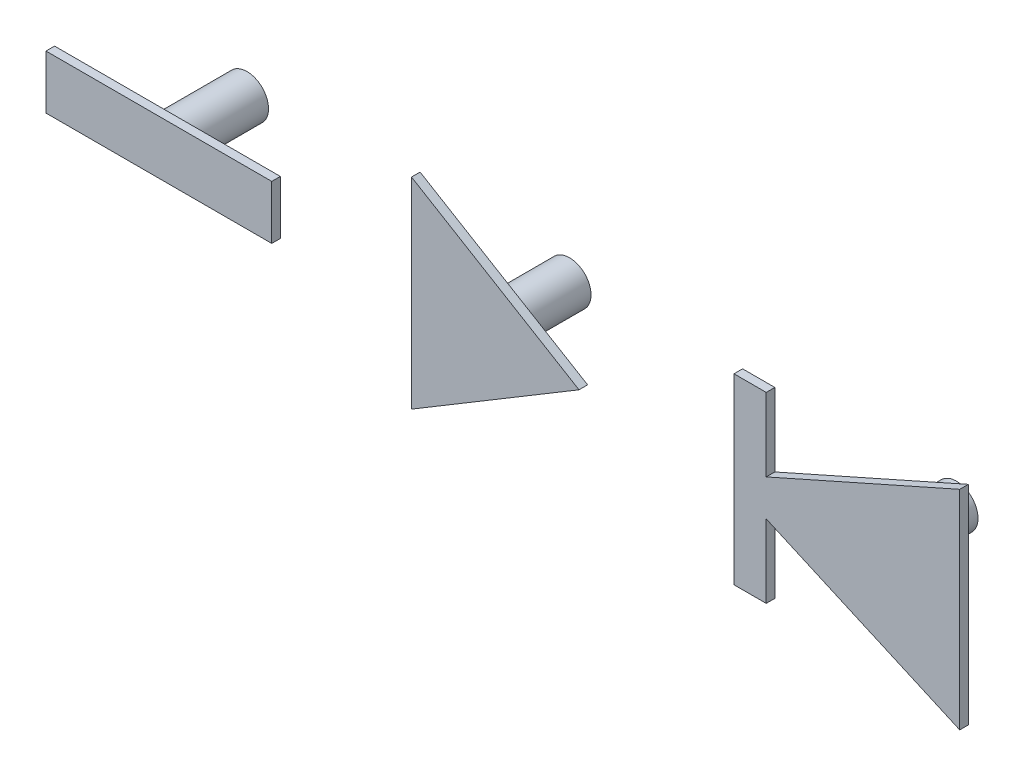
ISO-10303-21;
HEADER;
FILE_DESCRIPTION(('STEP AP214'),'2;1');
FILE_NAME('part.step','',(''),(''),'','','');
FILE_SCHEMA(('AUTOMOTIVE_DESIGN { 1 0 10303 214 1 1 1 1 }'));
ENDSEC;
DATA;
#1=APPLICATION_CONTEXT('core data for automotive mechanical design processes');
#2=APPLICATION_PROTOCOL_DEFINITION('international standard','automotive_design',2000,#1);
#3=PRODUCT_CONTEXT('',#1,'mechanical');
#4=PRODUCT('Part','Part','',(#3));
#5=PRODUCT_RELATED_PRODUCT_CATEGORY('part','',(#4));
#6=PRODUCT_DEFINITION_FORMATION('','',#4);
#7=PRODUCT_DEFINITION_CONTEXT('part definition',#1,'design');
#8=PRODUCT_DEFINITION('design','',#6,#7);
#9=PRODUCT_DEFINITION_SHAPE('','',#8);
#10=(LENGTH_UNIT() NAMED_UNIT(*) SI_UNIT(.MILLI.,.METRE.));
#11=(NAMED_UNIT(*) PLANE_ANGLE_UNIT() SI_UNIT($,.RADIAN.));
#12=(NAMED_UNIT(*) SI_UNIT($,.STERADIAN.) SOLID_ANGLE_UNIT());
#13=UNCERTAINTY_MEASURE_WITH_UNIT(LENGTH_MEASURE(1.E-05),#10,'distance_accuracy_value','');
#14=(GEOMETRIC_REPRESENTATION_CONTEXT(3) GLOBAL_UNCERTAINTY_ASSIGNED_CONTEXT((#13)) GLOBAL_UNIT_ASSIGNED_CONTEXT((#10,
#11,#12)) REPRESENTATION_CONTEXT('',''));
#15=CARTESIAN_POINT('',(0.,0.,0.));
#16=DIRECTION('',(0.,0.,1.));
#17=DIRECTION('',(1.,0.,0.));
#18=AXIS2_PLACEMENT_3D('',#15,#16,#17);
#19=CARTESIAN_POINT('',(-21.25,1.25,4.7));
#20=DIRECTION('',(-1.,0.,0.));
#21=DIRECTION('',(0.,0.,1.));
#22=AXIS2_PLACEMENT_3D('',#19,#20,#21);
#23=PLANE('',#22);
#24=DIRECTION('',(0.,0.,1.));
#25=VECTOR('',#24,1.);
#26=CARTESIAN_POINT('',(-21.25,-1.25,4.7));
#27=LINE('',#26,#25);
#28=CARTESIAN_POINT('',(-21.25,-1.25,4.7));
#29=VERTEX_POINT('',#28);
#30=CARTESIAN_POINT('',(-21.25,-1.25,5.1));
#31=VERTEX_POINT('',#30);
#32=EDGE_CURVE('E82',#29,#31,#27,.T.);
#33=ORIENTED_EDGE('',*,*,#32,.T.);
#34=DIRECTION('',(0.,-1.,0.));
#35=VECTOR('',#34,1.);
#36=CARTESIAN_POINT('',(-21.25,1.25,5.1));
#37=LINE('',#36,#35);
#38=CARTESIAN_POINT('',(-21.25,1.25,5.1));
#39=VERTEX_POINT('',#38);
#40=EDGE_CURVE('E85',#39,#31,#37,.T.);
#41=ORIENTED_EDGE('',*,*,#40,.F.);
#42=DIRECTION('',(0.,0.,1.));
#43=VECTOR('',#42,1.);
#44=CARTESIAN_POINT('',(-21.25,1.25,4.7));
#45=LINE('',#44,#43);
#46=CARTESIAN_POINT('',(-21.25,1.25,4.7));
#47=VERTEX_POINT('',#46);
#48=EDGE_CURVE('E12',#47,#39,#45,.T.);
#49=ORIENTED_EDGE('',*,*,#48,.F.);
#50=DIRECTION('',(0.,-1.,0.));
#51=VECTOR('',#50,1.);
#52=CARTESIAN_POINT('',(-21.25,1.25,4.7));
#53=LINE('',#52,#51);
#54=EDGE_CURVE('E86',#47,#29,#53,.T.);
#55=ORIENTED_EDGE('',*,*,#54,.T.);
#56=EDGE_LOOP('',(#33,#41,#49,#55));
#57=FACE_BOUND('',#56,.T.);
#58=ADVANCED_FACE('F44',(#57),#23,.T.);
#59=CARTESIAN_POINT('',(-21.25,1.25,4.7));
#60=DIRECTION('',(0.,1.,0.));
#61=DIRECTION('',(0.,0.,1.));
#62=AXIS2_PLACEMENT_3D('',#59,#60,#61);
#63=PLANE('',#62);
#64=ORIENTED_EDGE('',*,*,#48,.T.);
#65=DIRECTION('',(-1.,0.,0.));
#66=VECTOR('',#65,1.);
#67=CARTESIAN_POINT('',(-21.25,1.25,5.1));
#68=LINE('',#67,#66);
#69=CARTESIAN_POINT('',(-10.75,1.25,5.1));
#70=VERTEX_POINT('',#69);
#71=EDGE_CURVE('E102',#70,#39,#68,.T.);
#72=ORIENTED_EDGE('',*,*,#71,.F.);
#73=DIRECTION('',(0.,0.,1.));
#74=VECTOR('',#73,1.);
#75=CARTESIAN_POINT('',(-10.75,1.25,4.7));
#76=LINE('',#75,#74);
#77=CARTESIAN_POINT('',(-10.75,1.25,4.7));
#78=VERTEX_POINT('',#77);
#79=EDGE_CURVE('E52',#78,#70,#76,.T.);
#80=ORIENTED_EDGE('',*,*,#79,.F.);
#81=DIRECTION('',(-1.,0.,0.));
#82=VECTOR('',#81,1.);
#83=CARTESIAN_POINT('',(-21.25,1.25,4.7));
#84=LINE('',#83,#82);
#85=EDGE_CURVE('E91',#78,#47,#84,.T.);
#86=ORIENTED_EDGE('',*,*,#85,.T.);
#87=EDGE_LOOP('',(#64,#72,#80,#86));
#88=FACE_BOUND('',#87,.T.);
#89=ADVANCED_FACE('F121',(#88),#63,.T.);
#90=CARTESIAN_POINT('',(-10.75,1.25,4.7));
#91=DIRECTION('',(1.,0.,0.));
#92=DIRECTION('',(0.,0.,-1.));
#93=AXIS2_PLACEMENT_3D('',#90,#91,#92);
#94=PLANE('',#93);
#95=ORIENTED_EDGE('',*,*,#79,.T.);
#96=DIRECTION('',(0.,1.,0.));
#97=VECTOR('',#96,1.);
#98=CARTESIAN_POINT('',(-10.75,1.25,5.1));
#99=LINE('',#98,#97);
#100=CARTESIAN_POINT('',(-10.75,-1.25,5.1));
#101=VERTEX_POINT('',#100);
#102=EDGE_CURVE('E98',#101,#70,#99,.T.);
#103=ORIENTED_EDGE('',*,*,#102,.F.);
#104=DIRECTION('',(0.,0.,1.));
#105=VECTOR('',#104,1.);
#106=CARTESIAN_POINT('',(-10.75,-1.25,4.7));
#107=LINE('',#106,#105);
#108=CARTESIAN_POINT('',(-10.75,-1.25,4.7));
#109=VERTEX_POINT('',#108);
#110=EDGE_CURVE('E90',#109,#101,#107,.T.);
#111=ORIENTED_EDGE('',*,*,#110,.F.);
#112=DIRECTION('',(0.,1.,0.));
#113=VECTOR('',#112,1.);
#114=CARTESIAN_POINT('',(-10.75,1.25,4.7));
#115=LINE('',#114,#113);
#116=EDGE_CURVE('E113',#109,#78,#115,.T.);
#117=ORIENTED_EDGE('',*,*,#116,.T.);
#118=EDGE_LOOP('',(#95,#103,#111,#117));
#119=FACE_BOUND('',#118,.T.);
#120=ADVANCED_FACE('F118',(#119),#94,.T.);
#121=CARTESIAN_POINT('',(-21.25,-1.25,4.7));
#122=DIRECTION('',(0.,-1.,0.));
#123=DIRECTION('',(1.,0.,0.));
#124=AXIS2_PLACEMENT_3D('',#121,#122,#123);
#125=PLANE('',#124);
#126=ORIENTED_EDGE('',*,*,#110,.T.);
#127=DIRECTION('',(1.,0.,0.));
#128=VECTOR('',#127,1.);
#129=CARTESIAN_POINT('',(-21.25,-1.25,5.1));
#130=LINE('',#129,#128);
#131=EDGE_CURVE('E93',#31,#101,#130,.T.);
#132=ORIENTED_EDGE('',*,*,#131,.F.);
#133=ORIENTED_EDGE('',*,*,#32,.F.);
#134=DIRECTION('',(1.,0.,0.));
#135=VECTOR('',#134,1.);
#136=CARTESIAN_POINT('',(-21.25,-1.25,4.7));
#137=LINE('',#136,#135);
#138=EDGE_CURVE('E111',#29,#109,#137,.T.);
#139=ORIENTED_EDGE('',*,*,#138,.T.);
#140=EDGE_LOOP('',(#126,#132,#133,#139));
#141=FACE_BOUND('',#140,.T.);
#142=ADVANCED_FACE('F94',(#141),#125,.T.);
#143=CARTESIAN_POINT('',(0.,0.,4.7));
#144=DIRECTION('',(0.,0.,1.));
#145=DIRECTION('',(1.,0.,0.));
#146=AXIS2_PLACEMENT_3D('',#143,#144,#145);
#147=PLANE('',#146);
#148=CARTESIAN_POINT('',(-16.,0.,4.7));
#149=DIRECTION('',(0.,0.,1.));
#150=DIRECTION('',(1.,0.,0.));
#151=AXIS2_PLACEMENT_3D('',#148,#149,#150);
#152=CIRCLE('',#151,1.);
#153=CARTESIAN_POINT('',(-15.,0.,4.7));
#154=VERTEX_POINT('',#153);
#155=EDGE_CURVE('E47',#154,#154,#152,.T.);
#156=ORIENTED_EDGE('',*,*,#155,.T.);
#157=EDGE_LOOP('',(#156));
#158=FACE_BOUND('',#157,.T.);
#159=ORIENTED_EDGE('',*,*,#54,.F.);
#160=ORIENTED_EDGE('',*,*,#85,.F.);
#161=ORIENTED_EDGE('',*,*,#116,.F.);
#162=ORIENTED_EDGE('',*,*,#138,.F.);
#163=EDGE_LOOP('',(#159,#160,#161,#162));
#164=FACE_BOUND('',#163,.T.);
#165=ADVANCED_FACE('F123',(#158,#164),#147,.F.);
#166=CARTESIAN_POINT('',(0.,0.,5.1));
#167=DIRECTION('',(0.,0.,1.));
#168=DIRECTION('',(1.,0.,0.));
#169=AXIS2_PLACEMENT_3D('',#166,#167,#168);
#170=PLANE('',#169);
#171=ORIENTED_EDGE('',*,*,#40,.T.);
#172=ORIENTED_EDGE('',*,*,#131,.T.);
#173=ORIENTED_EDGE('',*,*,#102,.T.);
#174=ORIENTED_EDGE('',*,*,#71,.T.);
#175=EDGE_LOOP('',(#171,#172,#173,#174));
#176=FACE_BOUND('',#175,.T.);
#177=ADVANCED_FACE('F101',(#176),#170,.T.);
#178=CARTESIAN_POINT('',(-16.,0.,1.));
#179=DIRECTION('',(0.,0.,1.));
#180=DIRECTION('',(1.,0.,0.));
#181=AXIS2_PLACEMENT_3D('',#178,#179,#180);
#182=CYLINDRICAL_SURFACE('',#181,1.);
#183=CARTESIAN_POINT('',(-16.,0.,1.));
#184=DIRECTION('',(0.,0.,1.));
#185=DIRECTION('',(1.,0.,0.));
#186=AXIS2_PLACEMENT_3D('',#183,#184,#185);
#187=CIRCLE('',#186,1.);
#188=CARTESIAN_POINT('',(-15.,0.,1.));
#189=VERTEX_POINT('',#188);
#190=EDGE_CURVE('E105',#189,#189,#187,.T.);
#191=ORIENTED_EDGE('',*,*,#190,.T.);
#192=EDGE_LOOP('',(#191));
#193=FACE_BOUND('',#192,.T.);
#194=ORIENTED_EDGE('',*,*,#155,.F.);
#195=EDGE_LOOP('',(#194));
#196=FACE_BOUND('',#195,.T.);
#197=ADVANCED_FACE('F131',(#193,#196),#182,.T.);
#198=CARTESIAN_POINT('',(-16.,0.,1.));
#199=DIRECTION('',(0.,0.,1.));
#200=DIRECTION('',(1.,0.,0.));
#201=AXIS2_PLACEMENT_3D('',#198,#199,#200);
#202=PLANE('',#201);
#203=ORIENTED_EDGE('',*,*,#190,.F.);
#204=EDGE_LOOP('',(#203));
#205=FACE_BOUND('',#204,.T.);
#206=ADVANCED_FACE('F167',(#205),#202,.F.);
#207=CLOSED_SHELL('',(#58,#89,#120,#142,#165,#177,#197,#206));
#208=MANIFOLD_SOLID_BREP('B2',#207);
#209=CARTESIAN_POINT('',(12.25,4.25,4.7));
#210=DIRECTION('',(0.,1.,0.));
#211=DIRECTION('',(0.,0.,1.));
#212=AXIS2_PLACEMENT_3D('',#209,#210,#211);
#213=PLANE('',#212);
#214=DIRECTION('',(0.,0.,1.));
#215=VECTOR('',#214,1.);
#216=CARTESIAN_POINT('',(10.75,4.25,4.7));
#217=LINE('',#216,#215);
#218=CARTESIAN_POINT('',(10.75,4.25,4.7));
#219=VERTEX_POINT('',#218);
#220=CARTESIAN_POINT('',(10.75,4.25,5.1));
#221=VERTEX_POINT('',#220);
#222=EDGE_CURVE('E269',#219,#221,#217,.T.);
#223=ORIENTED_EDGE('',*,*,#222,.T.);
#224=DIRECTION('',(-1.,0.,0.));
#225=VECTOR('',#224,1.);
#226=CARTESIAN_POINT('',(12.25,4.25,5.1));
#227=LINE('',#226,#225);
#228=CARTESIAN_POINT('',(12.25,4.25,5.1));
#229=VERTEX_POINT('',#228);
#230=EDGE_CURVE('E272',#229,#221,#227,.T.);
#231=ORIENTED_EDGE('',*,*,#230,.F.);
#232=DIRECTION('',(0.,0.,1.));
#233=VECTOR('',#232,1.);
#234=CARTESIAN_POINT('',(12.25,4.25,4.7));
#235=LINE('',#234,#233);
#236=CARTESIAN_POINT('',(12.25,4.25,4.7));
#237=VERTEX_POINT('',#236);
#238=EDGE_CURVE('E42',#237,#229,#235,.T.);
#239=ORIENTED_EDGE('',*,*,#238,.F.);
#240=DIRECTION('',(-1.,0.,0.));
#241=VECTOR('',#240,1.);
#242=CARTESIAN_POINT('',(12.25,4.25,4.7));
#243=LINE('',#242,#241);
#244=EDGE_CURVE('E273',#237,#219,#243,.T.);
#245=ORIENTED_EDGE('',*,*,#244,.T.);
#246=EDGE_LOOP('',(#223,#231,#239,#245));
#247=FACE_BOUND('',#246,.T.);
#248=ADVANCED_FACE('F207',(#247),#213,.T.);
#249=CARTESIAN_POINT('',(12.25,0.845928516516991,4.7));
#250=DIRECTION('',(1.,0.,0.));
#251=DIRECTION('',(0.,0.,-1.));
#252=AXIS2_PLACEMENT_3D('',#249,#250,#251);
#253=PLANE('',#252);
#254=ORIENTED_EDGE('',*,*,#238,.T.);
#255=DIRECTION('',(0.,1.,0.));
#256=VECTOR('',#255,1.);
#257=CARTESIAN_POINT('',(12.25,0.845928516516991,5.1));
#258=LINE('',#257,#256);
#259=CARTESIAN_POINT('',(12.25,0.845928516516991,5.1));
#260=VERTEX_POINT('',#259);
#261=EDGE_CURVE('E290',#260,#229,#258,.T.);
#262=ORIENTED_EDGE('',*,*,#261,.F.);
#263=DIRECTION('',(0.,0.,1.));
#264=VECTOR('',#263,1.);
#265=CARTESIAN_POINT('',(12.25,0.845928516516991,4.7));
#266=LINE('',#265,#264);
#267=CARTESIAN_POINT('',(12.25,0.845928516516991,4.7));
#268=VERTEX_POINT('',#267);
#269=EDGE_CURVE('E215',#268,#260,#266,.T.);
#270=ORIENTED_EDGE('',*,*,#269,.F.);
#271=DIRECTION('',(0.,1.,0.));
#272=VECTOR('',#271,1.);
#273=CARTESIAN_POINT('',(12.25,0.845928516516991,4.7));
#274=LINE('',#273,#272);
#275=EDGE_CURVE('E278',#268,#237,#274,.T.);
#276=ORIENTED_EDGE('',*,*,#275,.T.);
#277=EDGE_LOOP('',(#254,#262,#270,#276));
#278=FACE_BOUND('',#277,.T.);
#279=ADVANCED_FACE('F358',(#278),#253,.T.);
#280=CARTESIAN_POINT('',(21.25,4.84592851651698,4.7));
#281=DIRECTION('',(-0.406138466053447,0.913811548620257,0.));
#282=DIRECTION('',(-0.913811548620257,-0.406138466053447,0.));
#283=AXIS2_PLACEMENT_3D('',#280,#281,#282);
#284=PLANE('',#283);
#285=ORIENTED_EDGE('',*,*,#269,.T.);
#286=DIRECTION('',(-0.913811548620257,-0.406138466053447,0.));
#287=VECTOR('',#286,1.);
#288=CARTESIAN_POINT('',(21.25,4.84592851651698,5.1));
#289=LINE('',#288,#287);
#290=CARTESIAN_POINT('',(21.25,4.84592851651698,5.1));
#291=VERTEX_POINT('',#290);
#292=EDGE_CURVE('E306',#291,#260,#289,.T.);
#293=ORIENTED_EDGE('',*,*,#292,.F.);
#294=DIRECTION('',(0.,0.,1.));
#295=VECTOR('',#294,1.);
#296=CARTESIAN_POINT('',(21.25,4.84592851651698,4.7));
#297=LINE('',#296,#295);
#298=CARTESIAN_POINT('',(21.25,4.84592851651698,4.7));
#299=VERTEX_POINT('',#298);
#300=EDGE_CURVE('E328',#299,#291,#297,.T.);
#301=ORIENTED_EDGE('',*,*,#300,.F.);
#302=DIRECTION('',(-0.913811548620257,-0.406138466053447,0.));
#303=VECTOR('',#302,1.);
#304=CARTESIAN_POINT('',(21.25,4.84592851651698,4.7));
#305=LINE('',#304,#303);
#306=EDGE_CURVE('E324',#299,#268,#305,.T.);
#307=ORIENTED_EDGE('',*,*,#306,.T.);
#308=EDGE_LOOP('',(#285,#293,#301,#307));
#309=FACE_BOUND('',#308,.T.);
#310=ADVANCED_FACE('F357',(#309),#284,.T.);
#311=CARTESIAN_POINT('',(21.25,-4.84592851651699,4.7));
#312=DIRECTION('',(1.,0.,0.));
#313=DIRECTION('',(0.,0.,-1.));
#314=AXIS2_PLACEMENT_3D('',#311,#312,#313);
#315=PLANE('',#314);
#316=ORIENTED_EDGE('',*,*,#300,.T.);
#317=DIRECTION('',(0.,1.,0.));
#318=VECTOR('',#317,1.);
#319=CARTESIAN_POINT('',(21.25,-4.84592851651699,5.1));
#320=LINE('',#319,#318);
#321=CARTESIAN_POINT('',(21.25,-4.84592851651699,5.1));
#322=VERTEX_POINT('',#321);
#323=EDGE_CURVE('E303',#322,#291,#320,.T.);
#324=ORIENTED_EDGE('',*,*,#323,.F.);
#325=DIRECTION('',(0.,0.,1.));
#326=VECTOR('',#325,1.);
#327=CARTESIAN_POINT('',(21.25,-4.84592851651699,4.7));
#328=LINE('',#327,#326);
#329=CARTESIAN_POINT('',(21.25,-4.84592851651699,4.7));
#330=VERTEX_POINT('',#329);
#331=EDGE_CURVE('E330',#330,#322,#328,.T.);
#332=ORIENTED_EDGE('',*,*,#331,.F.);
#333=DIRECTION('',(0.,1.,0.));
#334=VECTOR('',#333,1.);
#335=CARTESIAN_POINT('',(21.25,-4.84592851651699,4.7));
#336=LINE('',#335,#334);
#337=EDGE_CURVE('E321',#330,#299,#336,.T.);
#338=ORIENTED_EDGE('',*,*,#337,.T.);
#339=EDGE_LOOP('',(#316,#324,#332,#338));
#340=FACE_BOUND('',#339,.T.);
#341=ADVANCED_FACE('F353',(#340),#315,.T.);
#342=CARTESIAN_POINT('',(12.25,-0.845928516516989,4.7));
#343=DIRECTION('',(-0.406138466053448,-0.913811548620257,0.));
#344=DIRECTION('',(0.913811548620257,-0.406138466053448,0.));
#345=AXIS2_PLACEMENT_3D('',#342,#343,#344);
#346=PLANE('',#345);
#347=ORIENTED_EDGE('',*,*,#331,.T.);
#348=DIRECTION('',(0.913811548620257,-0.406138466053448,0.));
#349=VECTOR('',#348,1.);
#350=CARTESIAN_POINT('',(12.25,-0.845928516516989,5.1));
#351=LINE('',#350,#349);
#352=CARTESIAN_POINT('',(12.25,-0.845928516516989,5.1));
#353=VERTEX_POINT('',#352);
#354=EDGE_CURVE('E300',#353,#322,#351,.T.);
#355=ORIENTED_EDGE('',*,*,#354,.F.);
#356=DIRECTION('',(0.,0.,1.));
#357=VECTOR('',#356,1.);
#358=CARTESIAN_POINT('',(12.25,-0.845928516516989,4.7));
#359=LINE('',#358,#357);
#360=CARTESIAN_POINT('',(12.25,-0.845928516516989,4.7));
#361=VERTEX_POINT('',#360);
#362=EDGE_CURVE('E332',#361,#353,#359,.T.);
#363=ORIENTED_EDGE('',*,*,#362,.F.);
#364=DIRECTION('',(0.913811548620257,-0.406138466053448,0.));
#365=VECTOR('',#364,1.);
#366=CARTESIAN_POINT('',(12.25,-0.845928516516989,4.7));
#367=LINE('',#366,#365);
#368=EDGE_CURVE('E318',#361,#330,#367,.T.);
#369=ORIENTED_EDGE('',*,*,#368,.T.);
#370=EDGE_LOOP('',(#347,#355,#363,#369));
#371=FACE_BOUND('',#370,.T.);
#372=ADVANCED_FACE('F346',(#371),#346,.T.);
#373=CARTESIAN_POINT('',(12.25,-4.25,4.7));
#374=DIRECTION('',(1.,0.,0.));
#375=DIRECTION('',(0.,0.,-1.));
#376=AXIS2_PLACEMENT_3D('',#373,#374,#375);
#377=PLANE('',#376);
#378=ORIENTED_EDGE('',*,*,#362,.T.);
#379=DIRECTION('',(0.,1.,0.));
#380=VECTOR('',#379,1.);
#381=CARTESIAN_POINT('',(12.25,-4.25,5.1));
#382=LINE('',#381,#380);
#383=CARTESIAN_POINT('',(12.25,-4.25,5.1));
#384=VERTEX_POINT('',#383);
#385=EDGE_CURVE('E297',#384,#353,#382,.T.);
#386=ORIENTED_EDGE('',*,*,#385,.F.);
#387=DIRECTION('',(0.,0.,1.));
#388=VECTOR('',#387,1.);
#389=CARTESIAN_POINT('',(12.25,-4.25,4.7));
#390=LINE('',#389,#388);
#391=CARTESIAN_POINT('',(12.25,-4.25,4.7));
#392=VERTEX_POINT('',#391);
#393=EDGE_CURVE('E334',#392,#384,#390,.T.);
#394=ORIENTED_EDGE('',*,*,#393,.F.);
#395=DIRECTION('',(0.,1.,0.));
#396=VECTOR('',#395,1.);
#397=CARTESIAN_POINT('',(12.25,-4.25,4.7));
#398=LINE('',#397,#396);
#399=EDGE_CURVE('E315',#392,#361,#398,.T.);
#400=ORIENTED_EDGE('',*,*,#399,.T.);
#401=EDGE_LOOP('',(#378,#386,#394,#400));
#402=FACE_BOUND('',#401,.T.);
#403=ADVANCED_FACE('F343',(#402),#377,.T.);
#404=CARTESIAN_POINT('',(10.75,-4.25,4.7));
#405=DIRECTION('',(0.,-1.,0.));
#406=DIRECTION('',(0.,0.,-1.));
#407=AXIS2_PLACEMENT_3D('',#404,#405,#406);
#408=PLANE('',#407);
#409=ORIENTED_EDGE('',*,*,#393,.T.);
#410=DIRECTION('',(1.,0.,0.));
#411=VECTOR('',#410,1.);
#412=CARTESIAN_POINT('',(10.75,-4.25,5.1));
#413=LINE('',#412,#411);
#414=CARTESIAN_POINT('',(10.75,-4.25,5.1));
#415=VERTEX_POINT('',#414);
#416=EDGE_CURVE('E285',#415,#384,#413,.T.);
#417=ORIENTED_EDGE('',*,*,#416,.F.);
#418=DIRECTION('',(0.,0.,1.));
#419=VECTOR('',#418,1.);
#420=CARTESIAN_POINT('',(10.75,-4.25,4.7));
#421=LINE('',#420,#419);
#422=CARTESIAN_POINT('',(10.75,-4.25,4.7));
#423=VERTEX_POINT('',#422);
#424=EDGE_CURVE('E277',#423,#415,#421,.T.);
#425=ORIENTED_EDGE('',*,*,#424,.F.);
#426=DIRECTION('',(1.,0.,0.));
#427=VECTOR('',#426,1.);
#428=CARTESIAN_POINT('',(10.75,-4.25,4.7));
#429=LINE('',#428,#427);
#430=EDGE_CURVE('E312',#423,#392,#429,.T.);
#431=ORIENTED_EDGE('',*,*,#430,.T.);
#432=EDGE_LOOP('',(#409,#417,#425,#431));
#433=FACE_BOUND('',#432,.T.);
#434=ADVANCED_FACE('F337',(#433),#408,.T.);
#435=CARTESIAN_POINT('',(10.75,4.25,4.7));
#436=DIRECTION('',(-1.,0.,0.));
#437=DIRECTION('',(0.,0.,1.));
#438=AXIS2_PLACEMENT_3D('',#435,#436,#437);
#439=PLANE('',#438);
#440=ORIENTED_EDGE('',*,*,#424,.T.);
#441=DIRECTION('',(0.,-1.,0.));
#442=VECTOR('',#441,1.);
#443=CARTESIAN_POINT('',(10.75,4.25,5.1));
#444=LINE('',#443,#442);
#445=EDGE_CURVE('E280',#221,#415,#444,.T.);
#446=ORIENTED_EDGE('',*,*,#445,.F.);
#447=ORIENTED_EDGE('',*,*,#222,.F.);
#448=DIRECTION('',(0.,-1.,0.));
#449=VECTOR('',#448,1.);
#450=CARTESIAN_POINT('',(10.75,4.25,4.7));
#451=LINE('',#450,#449);
#452=EDGE_CURVE('E310',#219,#423,#451,.T.);
#453=ORIENTED_EDGE('',*,*,#452,.T.);
#454=EDGE_LOOP('',(#440,#446,#447,#453));
#455=FACE_BOUND('',#454,.T.);
#456=ADVANCED_FACE('F281',(#455),#439,.T.);
#457=CARTESIAN_POINT('',(0.,0.,4.7));
#458=DIRECTION('',(0.,0.,1.));
#459=DIRECTION('',(1.,0.,0.));
#460=AXIS2_PLACEMENT_3D('',#457,#458,#459);
#461=PLANE('',#460);
#462=CARTESIAN_POINT('',(17.,0.,4.7));
#463=DIRECTION('',(0.,0.,1.));
#464=DIRECTION('',(1.,0.,0.));
#465=AXIS2_PLACEMENT_3D('',#462,#463,#464);
#466=CIRCLE('',#465,1.);
#467=CARTESIAN_POINT('',(18.,0.,4.7));
#468=VERTEX_POINT('',#467);
#469=EDGE_CURVE('E210',#468,#468,#466,.T.);
#470=ORIENTED_EDGE('',*,*,#469,.T.);
#471=EDGE_LOOP('',(#470));
#472=FACE_BOUND('',#471,.T.);
#473=ORIENTED_EDGE('',*,*,#244,.F.);
#474=ORIENTED_EDGE('',*,*,#275,.F.);
#475=ORIENTED_EDGE('',*,*,#306,.F.);
#476=ORIENTED_EDGE('',*,*,#337,.F.);
#477=ORIENTED_EDGE('',*,*,#368,.F.);
#478=ORIENTED_EDGE('',*,*,#399,.F.);
#479=ORIENTED_EDGE('',*,*,#430,.F.);
#480=ORIENTED_EDGE('',*,*,#452,.F.);
#481=EDGE_LOOP('',(#473,#474,#475,#476,#477,#478,#479,#480));
#482=FACE_BOUND('',#481,.T.);
#483=ADVANCED_FACE('F349',(#472,#482),#461,.F.);
#484=CARTESIAN_POINT('',(0.,0.,5.1));
#485=DIRECTION('',(0.,0.,1.));
#486=DIRECTION('',(1.,0.,0.));
#487=AXIS2_PLACEMENT_3D('',#484,#485,#486);
#488=PLANE('',#487);
#489=ORIENTED_EDGE('',*,*,#230,.T.);
#490=ORIENTED_EDGE('',*,*,#445,.T.);
#491=ORIENTED_EDGE('',*,*,#416,.T.);
#492=ORIENTED_EDGE('',*,*,#385,.T.);
#493=ORIENTED_EDGE('',*,*,#354,.T.);
#494=ORIENTED_EDGE('',*,*,#323,.T.);
#495=ORIENTED_EDGE('',*,*,#292,.T.);
#496=ORIENTED_EDGE('',*,*,#261,.T.);
#497=EDGE_LOOP('',(#489,#490,#491,#492,#493,#494,#495,#496));
#498=FACE_BOUND('',#497,.T.);
#499=ADVANCED_FACE('F288',(#498),#488,.T.);
#500=CARTESIAN_POINT('',(17.,0.,1.));
#501=DIRECTION('',(0.,0.,1.));
#502=DIRECTION('',(1.,0.,0.));
#503=AXIS2_PLACEMENT_3D('',#500,#501,#502);
#504=CYLINDRICAL_SURFACE('',#503,1.);
#505=CARTESIAN_POINT('',(17.,0.,1.));
#506=DIRECTION('',(0.,0.,1.));
#507=DIRECTION('',(1.,0.,0.));
#508=AXIS2_PLACEMENT_3D('',#505,#506,#507);
#509=CIRCLE('',#508,1.);
#510=CARTESIAN_POINT('',(18.,0.,1.));
#511=VERTEX_POINT('',#510);
#512=EDGE_CURVE('E293',#511,#511,#509,.T.);
#513=ORIENTED_EDGE('',*,*,#512,.T.);
#514=EDGE_LOOP('',(#513));
#515=FACE_BOUND('',#514,.T.);
#516=ORIENTED_EDGE('',*,*,#469,.F.);
#517=EDGE_LOOP('',(#516));
#518=FACE_BOUND('',#517,.T.);
#519=ADVANCED_FACE('F384',(#515,#518),#504,.T.);
#520=CARTESIAN_POINT('',(17.,0.,1.));
#521=DIRECTION('',(0.,0.,1.));
#522=DIRECTION('',(1.,0.,0.));
#523=AXIS2_PLACEMENT_3D('',#520,#521,#522);
#524=PLANE('',#523);
#525=ORIENTED_EDGE('',*,*,#512,.F.);
#526=EDGE_LOOP('',(#525));
#527=FACE_BOUND('',#526,.T.);
#528=ADVANCED_FACE('F388',(#527),#524,.F.);
#529=CLOSED_SHELL('',(#248,#279,#310,#341,#372,#403,#434,#456,#483,#499,#519,#528));
#530=MANIFOLD_SOLID_BREP('B6',#529);
#531=CARTESIAN_POINT('',(3.54226202628867,0.,4.7));
#532=DIRECTION('',(0.514495755427526,0.857492925712544,0.));
#533=DIRECTION('',(-0.857492925712544,0.514495755427527,0.));
#534=AXIS2_PLACEMENT_3D('',#531,#532,#533);
#535=PLANE('',#534);
#536=DIRECTION('',(0.,0.,1.));
#537=VECTOR('',#536,1.);
#538=CARTESIAN_POINT('',(-4.25,4.6753572157732,4.7));
#539=LINE('',#538,#537);
#540=CARTESIAN_POINT('',(-4.25,4.6753572157732,4.7));
#541=VERTEX_POINT('',#540);
#542=CARTESIAN_POINT('',(-4.25,4.6753572157732,5.1));
#543=VERTEX_POINT('',#542);
#544=EDGE_CURVE('E497',#541,#543,#539,.T.);
#545=ORIENTED_EDGE('',*,*,#544,.T.);
#546=DIRECTION('',(-0.857492925712544,0.514495755427526,0.));
#547=VECTOR('',#546,1.);
#548=CARTESIAN_POINT('',(3.54226202628867,0.,5.1));
#549=LINE('',#548,#547);
#550=CARTESIAN_POINT('',(3.54226202628867,0.,5.1));
#551=VERTEX_POINT('',#550);
#552=EDGE_CURVE('E500',#551,#543,#549,.T.);
#553=ORIENTED_EDGE('',*,*,#552,.F.);
#554=DIRECTION('',(0.,0.,1.));
#555=VECTOR('',#554,1.);
#556=CARTESIAN_POINT('',(3.54226202628867,0.,4.7));
#557=LINE('',#556,#555);
#558=CARTESIAN_POINT('',(3.54226202628867,0.,4.7));
#559=VERTEX_POINT('',#558);
#560=EDGE_CURVE('E472',#559,#551,#557,.T.);
#561=ORIENTED_EDGE('',*,*,#560,.F.);
#562=DIRECTION('',(-0.857492925712544,0.514495755427526,0.));
#563=VECTOR('',#562,1.);
#564=CARTESIAN_POINT('',(3.54226202628867,0.,4.7));
#565=LINE('',#564,#563);
#566=EDGE_CURVE('E501',#559,#541,#565,.T.);
#567=ORIENTED_EDGE('',*,*,#566,.T.);
#568=EDGE_LOOP('',(#545,#553,#561,#567));
#569=FACE_BOUND('',#568,.T.);
#570=ADVANCED_FACE('F465',(#569),#535,.T.);
#571=CARTESIAN_POINT('',(-4.25,-4.6753572157732,4.7));
#572=DIRECTION('',(0.514495755427526,-0.857492925712544,0.));
#573=DIRECTION('',(0.857492925712545,0.514495755427526,0.));
#574=AXIS2_PLACEMENT_3D('',#571,#572,#573);
#575=PLANE('',#574);
#576=ORIENTED_EDGE('',*,*,#560,.T.);
#577=DIRECTION('',(0.857492925712544,0.514495755427526,0.));
#578=VECTOR('',#577,1.);
#579=CARTESIAN_POINT('',(-4.25,-4.6753572157732,5.1));
#580=LINE('',#579,#578);
#581=CARTESIAN_POINT('',(-4.25,-4.6753572157732,5.1));
#582=VERTEX_POINT('',#581);
#583=EDGE_CURVE('E510',#582,#551,#580,.T.);
#584=ORIENTED_EDGE('',*,*,#583,.F.);
#585=DIRECTION('',(0.,0.,1.));
#586=VECTOR('',#585,1.);
#587=CARTESIAN_POINT('',(-4.25,-4.6753572157732,4.7));
#588=LINE('',#587,#586);
#589=CARTESIAN_POINT('',(-4.25,-4.6753572157732,4.7));
#590=VERTEX_POINT('',#589);
#591=EDGE_CURVE('E486',#590,#582,#588,.T.);
#592=ORIENTED_EDGE('',*,*,#591,.F.);
#593=DIRECTION('',(0.857492925712544,0.514495755427526,0.));
#594=VECTOR('',#593,1.);
#595=CARTESIAN_POINT('',(-4.25,-4.6753572157732,4.7));
#596=LINE('',#595,#594);
#597=EDGE_CURVE('E504',#590,#559,#596,.T.);
#598=ORIENTED_EDGE('',*,*,#597,.T.);
#599=EDGE_LOOP('',(#576,#584,#592,#598));
#600=FACE_BOUND('',#599,.T.);
#601=ADVANCED_FACE('F524',(#600),#575,.T.);
#602=CARTESIAN_POINT('',(-4.25,4.6753572157732,4.7));
#603=DIRECTION('',(-1.,0.,0.));
#604=DIRECTION('',(0.,0.,1.));
#605=AXIS2_PLACEMENT_3D('',#602,#603,#604);
#606=PLANE('',#605);
#607=ORIENTED_EDGE('',*,*,#591,.T.);
#608=DIRECTION('',(0.,-1.,0.));
#609=VECTOR('',#608,1.);
#610=CARTESIAN_POINT('',(-4.25,4.6753572157732,5.1));
#611=LINE('',#610,#609);
#612=EDGE_CURVE('E506',#543,#582,#611,.T.);
#613=ORIENTED_EDGE('',*,*,#612,.F.);
#614=ORIENTED_EDGE('',*,*,#544,.F.);
#615=DIRECTION('',(0.,-1.,0.));
#616=VECTOR('',#615,1.);
#617=CARTESIAN_POINT('',(-4.25,4.6753572157732,4.7));
#618=LINE('',#617,#616);
#619=EDGE_CURVE('E520',#541,#590,#618,.T.);
#620=ORIENTED_EDGE('',*,*,#619,.T.);
#621=EDGE_LOOP('',(#607,#613,#614,#620));
#622=FACE_BOUND('',#621,.T.);
#623=ADVANCED_FACE('F507',(#622),#606,.T.);
#624=CARTESIAN_POINT('',(0.,0.,4.7));
#625=DIRECTION('',(0.,0.,-1.));
#626=DIRECTION('',(-1.,0.,0.));
#627=AXIS2_PLACEMENT_3D('',#624,#625,#626);
#628=PLANE('',#627);
#629=CARTESIAN_POINT('',(-1.,0.,4.7));
#630=DIRECTION('',(0.,0.,-1.));
#631=DIRECTION('',(-1.,0.,0.));
#632=AXIS2_PLACEMENT_3D('',#629,#630,#631);
#633=CIRCLE('',#632,1.);
#634=CARTESIAN_POINT('',(-2.,0.,4.7));
#635=VERTEX_POINT('',#634);
#636=EDGE_CURVE('E205',#635,#635,#633,.T.);
#637=ORIENTED_EDGE('',*,*,#636,.F.);
#638=EDGE_LOOP('',(#637));
#639=FACE_BOUND('',#638,.T.);
#640=ORIENTED_EDGE('',*,*,#566,.F.);
#641=ORIENTED_EDGE('',*,*,#597,.F.);
#642=ORIENTED_EDGE('',*,*,#619,.F.);
#643=EDGE_LOOP('',(#640,#641,#642));
#644=FACE_BOUND('',#643,.T.);
#645=ADVANCED_FACE('F527',(#639,#644),#628,.T.);
#646=CARTESIAN_POINT('',(0.,0.,5.1));
#647=DIRECTION('',(0.,0.,-1.));
#648=DIRECTION('',(-1.,0.,0.));
#649=AXIS2_PLACEMENT_3D('',#646,#647,#648);
#650=PLANE('',#649);
#651=ORIENTED_EDGE('',*,*,#552,.T.);
#652=ORIENTED_EDGE('',*,*,#612,.T.);
#653=ORIENTED_EDGE('',*,*,#583,.T.);
#654=EDGE_LOOP('',(#651,#652,#653));
#655=FACE_BOUND('',#654,.T.);
#656=ADVANCED_FACE('F512',(#655),#650,.F.);
#657=CARTESIAN_POINT('',(-1.,0.,1.));
#658=DIRECTION('',(0.,0.,1.));
#659=DIRECTION('',(1.,0.,0.));
#660=AXIS2_PLACEMENT_3D('',#657,#658,#659);
#661=CYLINDRICAL_SURFACE('',#660,1.);
#662=ORIENTED_EDGE('',*,*,#636,.T.);
#663=EDGE_LOOP('',(#662));
#664=FACE_BOUND('',#663,.T.);
#665=CARTESIAN_POINT('',(-1.,0.,1.));
#666=DIRECTION('',(0.,0.,1.));
#667=DIRECTION('',(1.,0.,0.));
#668=AXIS2_PLACEMENT_3D('',#665,#666,#667);
#669=CIRCLE('',#668,1.);
#670=CARTESIAN_POINT('',(0.,0.,1.));
#671=VERTEX_POINT('',#670);
#672=EDGE_CURVE('E513',#671,#671,#669,.T.);
#673=ORIENTED_EDGE('',*,*,#672,.T.);
#674=EDGE_LOOP('',(#673));
#675=FACE_BOUND('',#674,.T.);
#676=ADVANCED_FACE('F535',(#664,#675),#661,.T.);
#677=CARTESIAN_POINT('',(-1.,0.,1.));
#678=DIRECTION('',(0.,0.,1.));
#679=DIRECTION('',(1.,0.,0.));
#680=AXIS2_PLACEMENT_3D('',#677,#678,#679);
#681=PLANE('',#680);
#682=ORIENTED_EDGE('',*,*,#672,.F.);
#683=EDGE_LOOP('',(#682));
#684=FACE_BOUND('',#683,.T.);
#685=ADVANCED_FACE('F568',(#684),#681,.F.);
#686=CLOSED_SHELL('',(#570,#601,#623,#645,#656,#676,#685));
#687=MANIFOLD_SOLID_BREP('B36',#686);
#688=ADVANCED_BREP_SHAPE_REPRESENTATION('',(#18,#208,#530,#687),#14);
#689=SHAPE_DEFINITION_REPRESENTATION(#9,#688);
ENDSEC;
END-ISO-10303-21;
